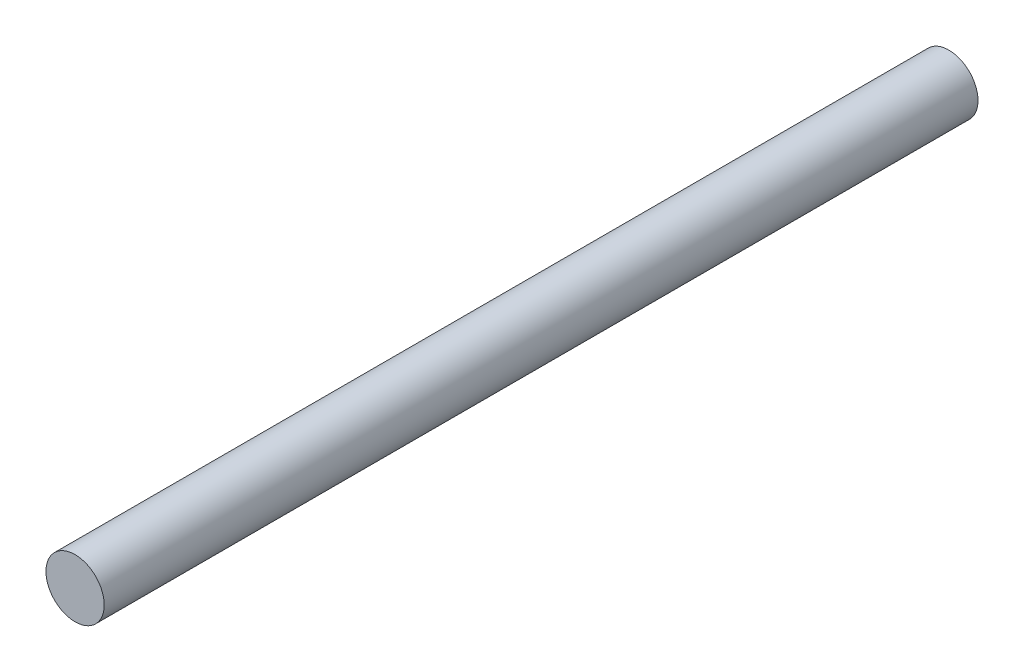
ISO-10303-21;
HEADER;
FILE_DESCRIPTION(('STEP AP214'),'2;1');
FILE_NAME('part.step','',(''),(''),'','','');
FILE_SCHEMA(('AUTOMOTIVE_DESIGN { 1 0 10303 214 1 1 1 1 }'));
ENDSEC;
DATA;
#1=APPLICATION_CONTEXT('core data for automotive mechanical design processes');
#2=APPLICATION_PROTOCOL_DEFINITION('international standard','automotive_design',2000,#1);
#3=PRODUCT_CONTEXT('',#1,'mechanical');
#4=PRODUCT('Part','Part','',(#3));
#5=PRODUCT_RELATED_PRODUCT_CATEGORY('part','',(#4));
#6=PRODUCT_DEFINITION_FORMATION('','',#4);
#7=PRODUCT_DEFINITION_CONTEXT('part definition',#1,'design');
#8=PRODUCT_DEFINITION('design','',#6,#7);
#9=PRODUCT_DEFINITION_SHAPE('','',#8);
#10=(LENGTH_UNIT() NAMED_UNIT(*) SI_UNIT(.MILLI.,.METRE.));
#11=(NAMED_UNIT(*) PLANE_ANGLE_UNIT() SI_UNIT($,.RADIAN.));
#12=(NAMED_UNIT(*) SI_UNIT($,.STERADIAN.) SOLID_ANGLE_UNIT());
#13=UNCERTAINTY_MEASURE_WITH_UNIT(LENGTH_MEASURE(1.E-05),#10,'distance_accuracy_value','');
#14=(GEOMETRIC_REPRESENTATION_CONTEXT(3) GLOBAL_UNCERTAINTY_ASSIGNED_CONTEXT((#13)) GLOBAL_UNIT_ASSIGNED_CONTEXT((#10,
#11,#12)) REPRESENTATION_CONTEXT('',''));
#15=CARTESIAN_POINT('',(0.,0.,0.));
#16=DIRECTION('',(0.,0.,1.));
#17=DIRECTION('',(1.,0.,0.));
#18=AXIS2_PLACEMENT_3D('',#15,#16,#17);
#19=CARTESIAN_POINT('',(0.,0.,300.));
#20=DIRECTION('',(0.,0.,-1.));
#21=DIRECTION('',(-1.,0.,0.));
#22=AXIS2_PLACEMENT_3D('',#19,#20,#21);
#23=CYLINDRICAL_SURFACE('',#22,10.);
#24=CARTESIAN_POINT('',(0.,0.,300.));
#25=DIRECTION('',(0.,0.,1.));
#26=DIRECTION('',(1.,0.,0.));
#27=AXIS2_PLACEMENT_3D('',#24,#25,#26);
#28=CIRCLE('',#27,10.);
#29=CARTESIAN_POINT('',(10.,0.,300.));
#30=VERTEX_POINT('',#29);
#31=EDGE_CURVE('E10',#30,#30,#28,.T.);
#32=ORIENTED_EDGE('',*,*,#31,.F.);
#33=EDGE_LOOP('',(#32));
#34=FACE_BOUND('',#33,.T.);
#35=CARTESIAN_POINT('',(0.,0.,0.));
#36=DIRECTION('',(0.,0.,1.));
#37=DIRECTION('',(1.,0.,0.));
#38=AXIS2_PLACEMENT_3D('',#35,#36,#37);
#39=CIRCLE('',#38,10.);
#40=CARTESIAN_POINT('',(10.,0.,0.));
#41=VERTEX_POINT('',#40);
#42=EDGE_CURVE('E44',#41,#41,#39,.T.);
#43=ORIENTED_EDGE('',*,*,#42,.T.);
#44=EDGE_LOOP('',(#43));
#45=FACE_BOUND('',#44,.T.);
#46=ADVANCED_FACE('F41',(#34,#45),#23,.T.);
#47=CARTESIAN_POINT('',(0.,0.,300.));
#48=DIRECTION('',(0.,0.,1.));
#49=DIRECTION('',(1.,0.,0.));
#50=AXIS2_PLACEMENT_3D('',#47,#48,#49);
#51=PLANE('',#50);
#52=ORIENTED_EDGE('',*,*,#31,.T.);
#53=EDGE_LOOP('',(#52));
#54=FACE_BOUND('',#53,.T.);
#55=ADVANCED_FACE('F58',(#54),#51,.T.);
#56=CARTESIAN_POINT('',(0.,0.,0.));
#57=DIRECTION('',(0.,0.,1.));
#58=DIRECTION('',(1.,0.,0.));
#59=AXIS2_PLACEMENT_3D('',#56,#57,#58);
#60=PLANE('',#59);
#61=ORIENTED_EDGE('',*,*,#42,.F.);
#62=EDGE_LOOP('',(#61));
#63=FACE_BOUND('',#62,.T.);
#64=ADVANCED_FACE('F56',(#63),#60,.F.);
#65=CLOSED_SHELL('',(#46,#55,#64));
#66=MANIFOLD_SOLID_BREP('B2',#65);
#67=ADVANCED_BREP_SHAPE_REPRESENTATION('',(#18,#66),#14);
#68=SHAPE_DEFINITION_REPRESENTATION(#9,#67);
ENDSEC;
END-ISO-10303-21;
